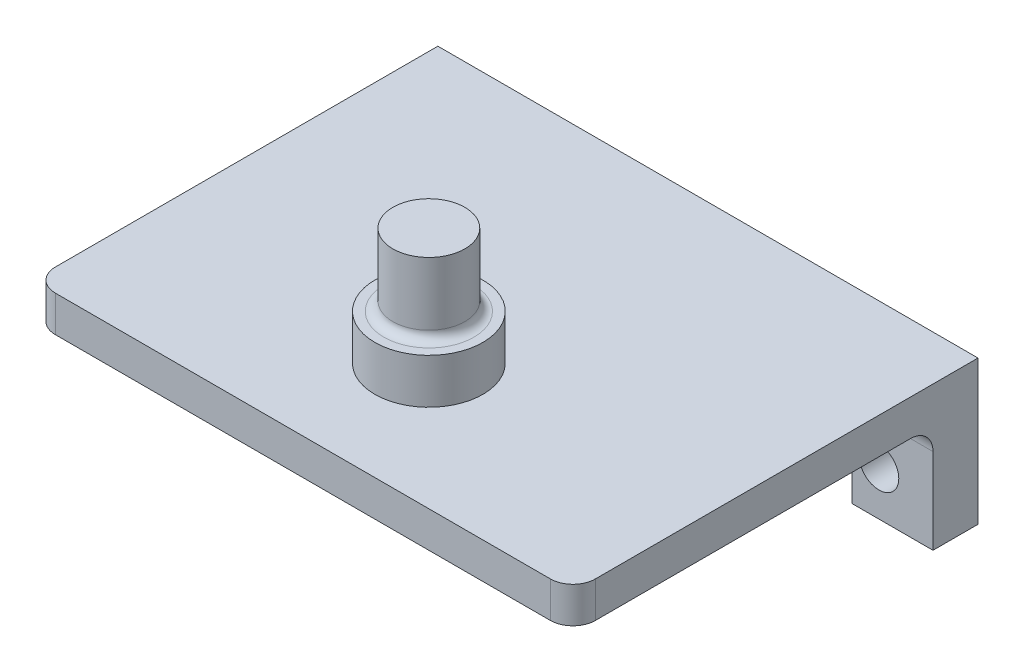
ISO-10303-21;
HEADER;
FILE_DESCRIPTION(('STEP AP214'),'2;1');
FILE_NAME('part.step','',(''),(''),'','','');
FILE_SCHEMA(('AUTOMOTIVE_DESIGN { 1 0 10303 214 1 1 1 1 }'));
ENDSEC;
DATA;
#1=APPLICATION_CONTEXT('core data for automotive mechanical design processes');
#2=APPLICATION_PROTOCOL_DEFINITION('international standard','automotive_design',2000,#1);
#3=PRODUCT_CONTEXT('',#1,'mechanical');
#4=PRODUCT('Part','Part','',(#3));
#5=PRODUCT_RELATED_PRODUCT_CATEGORY('part','',(#4));
#6=PRODUCT_DEFINITION_FORMATION('','',#4);
#7=PRODUCT_DEFINITION_CONTEXT('part definition',#1,'design');
#8=PRODUCT_DEFINITION('design','',#6,#7);
#9=PRODUCT_DEFINITION_SHAPE('','',#8);
#10=(LENGTH_UNIT() NAMED_UNIT(*) SI_UNIT(.MILLI.,.METRE.));
#11=(NAMED_UNIT(*) PLANE_ANGLE_UNIT() SI_UNIT($,.RADIAN.));
#12=(NAMED_UNIT(*) SI_UNIT($,.STERADIAN.) SOLID_ANGLE_UNIT());
#13=UNCERTAINTY_MEASURE_WITH_UNIT(LENGTH_MEASURE(1.E-05),#10,'distance_accuracy_value','');
#14=(GEOMETRIC_REPRESENTATION_CONTEXT(3) GLOBAL_UNCERTAINTY_ASSIGNED_CONTEXT((#13)) GLOBAL_UNIT_ASSIGNED_CONTEXT((#10,
#11,#12)) REPRESENTATION_CONTEXT('',''));
#15=CARTESIAN_POINT('',(0.,0.,0.));
#16=DIRECTION('',(0.,0.,1.));
#17=DIRECTION('',(1.,0.,0.));
#18=AXIS2_PLACEMENT_3D('',#15,#16,#17);
#19=CARTESIAN_POINT('',(-112.025641025641,3.8866701879706E-13,45.));
#20=DIRECTION('',(1.,0.,0.));
#21=DIRECTION('',(0.,1.,0.));
#22=AXIS2_PLACEMENT_3D('',#19,#20,#21);
#23=PLANE('',#22);
#24=DIRECTION('',(0.,-1.,0.));
#25=VECTOR('',#24,1.);
#26=CARTESIAN_POINT('',(-112.025641025641,3.8866701879706E-13,0.));
#27=LINE('',#26,#25);
#28=CARTESIAN_POINT('',(-112.025641025641,35.6851761951193,0.));
#29=VERTEX_POINT('',#28);
#30=CARTESIAN_POINT('',(-112.025641025641,19.6851761951191,0.));
#31=VERTEX_POINT('',#30);
#32=EDGE_CURVE('E166',#29,#31,#27,.T.);
#33=ORIENTED_EDGE('',*,*,#32,.T.);
#34=DIRECTION('',(0.,0.,1.));
#35=VECTOR('',#34,1.);
#36=CARTESIAN_POINT('',(-112.025641025641,19.6851761951191,0.));
#37=LINE('',#36,#35);
#38=CARTESIAN_POINT('',(-112.025641025641,19.6851761951191,5.));
#39=VERTEX_POINT('',#38);
#40=EDGE_CURVE('E148',#31,#39,#37,.T.);
#41=ORIENTED_EDGE('',*,*,#40,.T.);
#42=DIRECTION('',(0.,1.,0.));
#43=VECTOR('',#42,1.);
#44=CARTESIAN_POINT('',(-112.025641025641,0.,5.));
#45=LINE('',#44,#43);
#46=CARTESIAN_POINT('',(-112.025641025641,29.1851761951193,5.));
#47=VERTEX_POINT('',#46);
#48=EDGE_CURVE('E185',#39,#47,#45,.T.);
#49=ORIENTED_EDGE('',*,*,#48,.T.);
#50=CARTESIAN_POINT('',(-112.025641025641,29.1851761951193,7.5));
#51=DIRECTION('',(1.,0.,0.));
#52=DIRECTION('',(0.,1.,0.));
#53=AXIS2_PLACEMENT_3D('',#50,#51,#52);
#54=CIRCLE('',#53,2.5);
#55=CARTESIAN_POINT('',(-112.025641025641,31.6851761951193,7.50000000000001));
#56=VERTEX_POINT('',#55);
#57=EDGE_CURVE('E239',#47,#56,#54,.T.);
#58=ORIENTED_EDGE('',*,*,#57,.T.);
#59=DIRECTION('',(0.,0.,-1.));
#60=VECTOR('',#59,1.);
#61=CARTESIAN_POINT('',(-112.025641025641,31.6851761951193,45.));
#62=LINE('',#61,#60);
#63=CARTESIAN_POINT('',(-112.025641025641,31.6851761951193,42.5));
#64=VERTEX_POINT('',#63);
#65=EDGE_CURVE('E287',#64,#56,#62,.T.);
#66=ORIENTED_EDGE('',*,*,#65,.F.);
#67=DIRECTION('',(0.,1.,0.));
#68=VECTOR('',#67,1.);
#69=CARTESIAN_POINT('',(-112.025641025641,35.6851761951193,42.5));
#70=LINE('',#69,#68);
#71=CARTESIAN_POINT('',(-112.025641025641,35.6851761951193,42.5));
#72=VERTEX_POINT('',#71);
#73=EDGE_CURVE('E210',#64,#72,#70,.T.);
#74=ORIENTED_EDGE('',*,*,#73,.T.);
#75=DIRECTION('',(0.,0.,-1.));
#76=VECTOR('',#75,1.);
#77=CARTESIAN_POINT('',(-112.025641025641,35.6851761951193,45.));
#78=LINE('',#77,#76);
#79=EDGE_CURVE('E175',#72,#29,#78,.T.);
#80=ORIENTED_EDGE('',*,*,#79,.T.);
#81=EDGE_LOOP('',(#33,#41,#49,#58,#66,#74,#80));
#82=FACE_BOUND('',#81,.T.);
#83=ADVANCED_FACE('F49',(#82),#23,.F.);
#84=CARTESIAN_POINT('',(-52.0256410256409,-1.80500201679843E-13,45.));
#85=DIRECTION('',(1.,0.,0.));
#86=DIRECTION('',(0.,1.,0.));
#87=AXIS2_PLACEMENT_3D('',#84,#85,#86);
#88=PLANE('',#87);
#89=DIRECTION('',(0.,0.,1.));
#90=VECTOR('',#89,1.);
#91=CARTESIAN_POINT('',(-52.025641025641,19.6851761951193,0.));
#92=LINE('',#91,#90);
#93=CARTESIAN_POINT('',(-52.025641025641,19.6851761951193,0.));
#94=VERTEX_POINT('',#93);
#95=CARTESIAN_POINT('',(-52.0256410256409,19.6851761951193,5.));
#96=VERTEX_POINT('',#95);
#97=EDGE_CURVE('E72',#94,#96,#92,.T.);
#98=ORIENTED_EDGE('',*,*,#97,.F.);
#99=DIRECTION('',(0.,-1.,0.));
#100=VECTOR('',#99,1.);
#101=CARTESIAN_POINT('',(-52.0256410256409,-1.80500201679843E-13,0.));
#102=LINE('',#101,#100);
#103=CARTESIAN_POINT('',(-52.0256410256409,35.6851761951193,0.));
#104=VERTEX_POINT('',#103);
#105=EDGE_CURVE('E177',#104,#94,#102,.T.);
#106=ORIENTED_EDGE('',*,*,#105,.F.);
#107=DIRECTION('',(0.,0.,-1.));
#108=VECTOR('',#107,1.);
#109=CARTESIAN_POINT('',(-52.0256410256409,35.6851761951193,45.));
#110=LINE('',#109,#108);
#111=CARTESIAN_POINT('',(-52.0256410256409,35.6851761951193,42.5));
#112=VERTEX_POINT('',#111);
#113=EDGE_CURVE('E296',#112,#104,#110,.T.);
#114=ORIENTED_EDGE('',*,*,#113,.F.);
#115=DIRECTION('',(0.,1.,0.));
#116=VECTOR('',#115,1.);
#117=CARTESIAN_POINT('',(-52.0256410256409,-1.80500201679843E-13,42.5));
#118=LINE('',#117,#116);
#119=CARTESIAN_POINT('',(-52.0256410256409,31.6851761951193,42.5));
#120=VERTEX_POINT('',#119);
#121=EDGE_CURVE('E201',#112,#120,#118,.F.);
#122=ORIENTED_EDGE('',*,*,#121,.T.);
#123=DIRECTION('',(0.,0.,-1.));
#124=VECTOR('',#123,1.);
#125=CARTESIAN_POINT('',(-52.0256410256409,31.6851761951193,45.));
#126=LINE('',#125,#124);
#127=CARTESIAN_POINT('',(-52.0256410256409,31.6851761951193,7.50000000000001));
#128=VERTEX_POINT('',#127);
#129=EDGE_CURVE('E299',#120,#128,#126,.T.);
#130=ORIENTED_EDGE('',*,*,#129,.T.);
#131=CARTESIAN_POINT('',(-52.025641025641,29.1851761951193,7.5));
#132=DIRECTION('',(1.,0.,0.));
#133=DIRECTION('',(0.,1.,0.));
#134=AXIS2_PLACEMENT_3D('',#131,#132,#133);
#135=CIRCLE('',#134,2.5);
#136=CARTESIAN_POINT('',(-52.0256410256409,29.1851761951193,5.));
#137=VERTEX_POINT('',#136);
#138=EDGE_CURVE('E228',#128,#137,#135,.F.);
#139=ORIENTED_EDGE('',*,*,#138,.T.);
#140=DIRECTION('',(0.,1.,0.));
#141=VECTOR('',#140,1.);
#142=CARTESIAN_POINT('',(-52.025641025641,0.,5.));
#143=LINE('',#142,#141);
#144=EDGE_CURVE('E304',#96,#137,#143,.T.);
#145=ORIENTED_EDGE('',*,*,#144,.F.);
#146=EDGE_LOOP('',(#98,#106,#114,#122,#130,#139,#145));
#147=FACE_BOUND('',#146,.T.);
#148=ADVANCED_FACE('F360',(#147),#88,.T.);
#149=CARTESIAN_POINT('',(0.,0.,0.));
#150=DIRECTION('',(0.,0.,1.));
#151=DIRECTION('',(1.,0.,0.));
#152=AXIS2_PLACEMENT_3D('',#149,#150,#151);
#153=PLANE('',#152);
#154=ORIENTED_EDGE('',*,*,#105,.T.);
#155=DIRECTION('',(1.,0.,0.));
#156=VECTOR('',#155,1.);
#157=CARTESIAN_POINT('',(-112.025641025641,19.6851761951191,0.));
#158=LINE('',#157,#156);
#159=CARTESIAN_POINT('',(-61.025641025641,19.6851761951193,0.));
#160=VERTEX_POINT('',#159);
#161=EDGE_CURVE('E157',#160,#94,#158,.T.);
#162=ORIENTED_EDGE('',*,*,#161,.F.);
#163=DIRECTION('',(0.,-1.,0.));
#164=VECTOR('',#163,1.);
#165=CARTESIAN_POINT('',(-61.0256410256409,0.,0.));
#166=LINE('',#165,#164);
#167=CARTESIAN_POINT('',(-61.0256410256409,31.6851761951193,0.));
#168=VERTEX_POINT('',#167);
#169=EDGE_CURVE('E303',#168,#160,#166,.T.);
#170=ORIENTED_EDGE('',*,*,#169,.F.);
#171=DIRECTION('',(1.,0.,0.));
#172=VECTOR('',#171,1.);
#173=CARTESIAN_POINT('',(0.,31.6851761951193,0.));
#174=LINE('',#173,#172);
#175=CARTESIAN_POINT('',(-103.025641025641,31.6851761951193,0.));
#176=VERTEX_POINT('',#175);
#177=EDGE_CURVE('E267',#176,#168,#174,.T.);
#178=ORIENTED_EDGE('',*,*,#177,.F.);
#179=DIRECTION('',(0.,-1.,0.));
#180=VECTOR('',#179,1.);
#181=CARTESIAN_POINT('',(-103.025641025641,-9.53178656611939E-13,0.));
#182=LINE('',#181,#180);
#183=CARTESIAN_POINT('',(-103.025641025641,19.6851761951191,0.));
#184=VERTEX_POINT('',#183);
#185=EDGE_CURVE('E169',#176,#184,#182,.T.);
#186=ORIENTED_EDGE('',*,*,#185,.T.);
#187=EDGE_CURVE('E151',#31,#184,#158,.T.);
#188=ORIENTED_EDGE('',*,*,#187,.F.);
#189=ORIENTED_EDGE('',*,*,#32,.F.);
#190=DIRECTION('',(1.,0.,0.));
#191=VECTOR('',#190,1.);
#192=CARTESIAN_POINT('',(0.,35.6851761951193,0.));
#193=LINE('',#192,#191);
#194=EDGE_CURVE('E273',#29,#104,#193,.T.);
#195=ORIENTED_EDGE('',*,*,#194,.T.);
#196=EDGE_LOOP('',(#154,#162,#170,#178,#186,#188,#189,#195));
#197=FACE_BOUND('',#196,.T.);
#198=CARTESIAN_POINT('',(-106.025641025641,24.6851761951193,0.));
#199=DIRECTION('',(0.,0.,1.));
#200=DIRECTION('',(1.,0.,0.));
#201=AXIS2_PLACEMENT_3D('',#198,#199,#200);
#202=CIRCLE('',#201,2.2);
#203=CARTESIAN_POINT('',(-103.825641025641,24.6851761951193,0.));
#204=VERTEX_POINT('',#203);
#205=EDGE_CURVE('E325',#204,#204,#202,.T.);
#206=ORIENTED_EDGE('',*,*,#205,.T.);
#207=EDGE_LOOP('',(#206));
#208=FACE_BOUND('',#207,.T.);
#209=CARTESIAN_POINT('',(-58.025641025641,24.6851761951193,0.));
#210=DIRECTION('',(0.,0.,1.));
#211=DIRECTION('',(1.,0.,0.));
#212=AXIS2_PLACEMENT_3D('',#209,#210,#211);
#213=CIRCLE('',#212,2.2);
#214=CARTESIAN_POINT('',(-55.825641025641,24.6851761951193,0.));
#215=VERTEX_POINT('',#214);
#216=EDGE_CURVE('E308',#215,#215,#213,.F.);
#217=ORIENTED_EDGE('',*,*,#216,.F.);
#218=EDGE_LOOP('',(#217));
#219=FACE_BOUND('',#218,.T.);
#220=ADVANCED_FACE('F163',(#197,#208,#219),#153,.F.);
#221=CARTESIAN_POINT('',(-103.025641025641,-9.53178656611939E-13,5.));
#222=DIRECTION('',(1.,0.,0.));
#223=DIRECTION('',(0.,1.,0.));
#224=AXIS2_PLACEMENT_3D('',#221,#222,#223);
#225=PLANE('',#224);
#226=DIRECTION('',(0.,0.,1.));
#227=VECTOR('',#226,1.);
#228=CARTESIAN_POINT('',(-103.025641025641,19.6851761951191,5.));
#229=LINE('',#228,#227);
#230=CARTESIAN_POINT('',(-103.025641025641,19.6851761951191,5.));
#231=VERTEX_POINT('',#230);
#232=EDGE_CURVE('E65',#184,#231,#229,.T.);
#233=ORIENTED_EDGE('',*,*,#232,.F.);
#234=ORIENTED_EDGE('',*,*,#185,.F.);
#235=DIRECTION('',(0.,0.,-1.));
#236=VECTOR('',#235,1.);
#237=CARTESIAN_POINT('',(-103.025641025641,31.6851761951193,5.));
#238=LINE('',#237,#236);
#239=CARTESIAN_POINT('',(-103.025641025641,31.6851761951193,7.5));
#240=VERTEX_POINT('',#239);
#241=EDGE_CURVE('E178',#240,#176,#238,.T.);
#242=ORIENTED_EDGE('',*,*,#241,.F.);
#243=CARTESIAN_POINT('',(-103.025641025641,29.1851761951193,7.5));
#244=DIRECTION('',(1.,0.,0.));
#245=DIRECTION('',(0.,1.,0.));
#246=AXIS2_PLACEMENT_3D('',#243,#244,#245);
#247=CIRCLE('',#246,2.5);
#248=CARTESIAN_POINT('',(-103.025641025641,29.1851761951193,5.));
#249=VERTEX_POINT('',#248);
#250=EDGE_CURVE('E236',#240,#249,#247,.F.);
#251=ORIENTED_EDGE('',*,*,#250,.T.);
#252=DIRECTION('',(0.,-1.,0.));
#253=VECTOR('',#252,1.);
#254=CARTESIAN_POINT('',(-103.025641025641,-9.53178656611939E-13,5.));
#255=LINE('',#254,#253);
#256=EDGE_CURVE('E330',#249,#231,#255,.T.);
#257=ORIENTED_EDGE('',*,*,#256,.T.);
#258=EDGE_LOOP('',(#233,#234,#242,#251,#257));
#259=FACE_BOUND('',#258,.T.);
#260=ADVANCED_FACE('F345',(#259),#225,.T.);
#261=CARTESIAN_POINT('',(-106.025641025641,24.6851761951193,5.));
#262=DIRECTION('',(0.,0.,-1.));
#263=DIRECTION('',(-1.,0.,0.));
#264=AXIS2_PLACEMENT_3D('',#261,#262,#263);
#265=CYLINDRICAL_SURFACE('',#264,2.2);
#266=CARTESIAN_POINT('',(-106.025641025641,24.6851761951193,5.));
#267=DIRECTION('',(0.,0.,1.));
#268=DIRECTION('',(1.,0.,0.));
#269=AXIS2_PLACEMENT_3D('',#266,#267,#268);
#270=CIRCLE('',#269,2.2);
#271=CARTESIAN_POINT('',(-103.825641025641,24.6851761951193,5.));
#272=VERTEX_POINT('',#271);
#273=EDGE_CURVE('E326',#272,#272,#270,.T.);
#274=ORIENTED_EDGE('',*,*,#273,.T.);
#275=EDGE_LOOP('',(#274));
#276=FACE_BOUND('',#275,.T.);
#277=ORIENTED_EDGE('',*,*,#205,.F.);
#278=EDGE_LOOP('',(#277));
#279=FACE_BOUND('',#278,.T.);
#280=ADVANCED_FACE('F342',(#276,#279),#265,.F.);
#281=CARTESIAN_POINT('',(0.,0.,5.));
#282=DIRECTION('',(0.,0.,1.));
#283=DIRECTION('',(1.,0.,0.));
#284=AXIS2_PLACEMENT_3D('',#281,#282,#283);
#285=PLANE('',#284);
#286=DIRECTION('',(-1.,0.,0.));
#287=VECTOR('',#286,1.);
#288=CARTESIAN_POINT('',(0.,19.6851761951195,5.));
#289=LINE('',#288,#287);
#290=EDGE_CURVE('E152',#231,#39,#289,.T.);
#291=ORIENTED_EDGE('',*,*,#290,.F.);
#292=ORIENTED_EDGE('',*,*,#256,.F.);
#293=DIRECTION('',(1.,0.,0.));
#294=VECTOR('',#293,1.);
#295=CARTESIAN_POINT('',(0.,29.1851761951193,5.));
#296=LINE('',#295,#294);
#297=EDGE_CURVE('E213',#249,#47,#296,.F.);
#298=ORIENTED_EDGE('',*,*,#297,.T.);
#299=ORIENTED_EDGE('',*,*,#48,.F.);
#300=EDGE_LOOP('',(#291,#292,#298,#299));
#301=FACE_BOUND('',#300,.T.);
#302=ORIENTED_EDGE('',*,*,#273,.F.);
#303=EDGE_LOOP('',(#302));
#304=FACE_BOUND('',#303,.T.);
#305=ADVANCED_FACE('F344',(#301,#304),#285,.T.);
#306=CARTESIAN_POINT('',(-61.0256410256409,0.,5.));
#307=DIRECTION('',(1.,0.,0.));
#308=DIRECTION('',(0.,0.,-1.));
#309=AXIS2_PLACEMENT_3D('',#306,#307,#308);
#310=PLANE('',#309);
#311=ORIENTED_EDGE('',*,*,#169,.T.);
#312=DIRECTION('',(0.,0.,1.));
#313=VECTOR('',#312,1.);
#314=CARTESIAN_POINT('',(-61.0256410256409,19.6851761951193,5.));
#315=LINE('',#314,#313);
#316=CARTESIAN_POINT('',(-61.0256410256409,19.6851761951193,5.));
#317=VERTEX_POINT('',#316);
#318=EDGE_CURVE('E171',#160,#317,#315,.T.);
#319=ORIENTED_EDGE('',*,*,#318,.T.);
#320=DIRECTION('',(0.,-1.,0.));
#321=VECTOR('',#320,1.);
#322=CARTESIAN_POINT('',(-61.0256410256409,0.,5.));
#323=LINE('',#322,#321);
#324=CARTESIAN_POINT('',(-61.0256410256409,29.1851761951193,5.));
#325=VERTEX_POINT('',#324);
#326=EDGE_CURVE('E307',#325,#317,#323,.T.);
#327=ORIENTED_EDGE('',*,*,#326,.F.);
#328=CARTESIAN_POINT('',(-61.0256410256409,29.1851761951193,7.5));
#329=DIRECTION('',(1.,0.,0.));
#330=DIRECTION('',(0.,0.,-1.));
#331=AXIS2_PLACEMENT_3D('',#328,#329,#330);
#332=CIRCLE('',#331,2.5);
#333=CARTESIAN_POINT('',(-61.0256410256409,31.6851761951193,7.5));
#334=VERTEX_POINT('',#333);
#335=EDGE_CURVE('E232',#325,#334,#332,.T.);
#336=ORIENTED_EDGE('',*,*,#335,.T.);
#337=DIRECTION('',(0.,0.,-1.));
#338=VECTOR('',#337,1.);
#339=CARTESIAN_POINT('',(-61.0256410256409,31.6851761951193,5.));
#340=LINE('',#339,#338);
#341=EDGE_CURVE('E316',#334,#168,#340,.T.);
#342=ORIENTED_EDGE('',*,*,#341,.T.);
#343=EDGE_LOOP('',(#311,#319,#327,#336,#342));
#344=FACE_BOUND('',#343,.T.);
#345=ADVANCED_FACE('F352',(#344),#310,.F.);
#346=CARTESIAN_POINT('',(-58.025641025641,24.6851761951193,5.));
#347=DIRECTION('',(0.,0.,-1.));
#348=DIRECTION('',(-1.,0.,0.));
#349=AXIS2_PLACEMENT_3D('',#346,#347,#348);
#350=CYLINDRICAL_SURFACE('',#349,2.2);
#351=CARTESIAN_POINT('',(-58.025641025641,24.6851761951193,5.));
#352=DIRECTION('',(0.,0.,1.));
#353=DIRECTION('',(1.,0.,0.));
#354=AXIS2_PLACEMENT_3D('',#351,#352,#353);
#355=CIRCLE('',#354,2.2);
#356=CARTESIAN_POINT('',(-55.825641025641,24.6851761951193,5.));
#357=VERTEX_POINT('',#356);
#358=EDGE_CURVE('E312',#357,#357,#355,.F.);
#359=ORIENTED_EDGE('',*,*,#358,.F.);
#360=EDGE_LOOP('',(#359));
#361=FACE_BOUND('',#360,.T.);
#362=ORIENTED_EDGE('',*,*,#216,.T.);
#363=EDGE_LOOP('',(#362));
#364=FACE_BOUND('',#363,.T.);
#365=ADVANCED_FACE('F437',(#361,#364),#350,.F.);
#366=CARTESIAN_POINT('',(0.,0.,5.));
#367=DIRECTION('',(0.,0.,1.));
#368=DIRECTION('',(1.,0.,0.));
#369=AXIS2_PLACEMENT_3D('',#366,#367,#368);
#370=PLANE('',#369);
#371=DIRECTION('',(-1.,0.,0.));
#372=VECTOR('',#371,1.);
#373=CARTESIAN_POINT('',(0.,19.6851761951195,5.));
#374=LINE('',#373,#372);
#375=EDGE_CURVE('E11',#96,#317,#374,.T.);
#376=ORIENTED_EDGE('',*,*,#375,.F.);
#377=ORIENTED_EDGE('',*,*,#144,.T.);
#378=DIRECTION('',(1.,0.,0.));
#379=VECTOR('',#378,1.);
#380=CARTESIAN_POINT('',(0.,29.1851761951193,5.));
#381=LINE('',#380,#379);
#382=EDGE_CURVE('E217',#137,#325,#381,.F.);
#383=ORIENTED_EDGE('',*,*,#382,.T.);
#384=ORIENTED_EDGE('',*,*,#326,.T.);
#385=EDGE_LOOP('',(#376,#377,#383,#384));
#386=FACE_BOUND('',#385,.T.);
#387=ORIENTED_EDGE('',*,*,#358,.T.);
#388=EDGE_LOOP('',(#387));
#389=FACE_BOUND('',#388,.T.);
#390=ADVANCED_FACE('F432',(#386,#389),#370,.T.);
#391=CARTESIAN_POINT('',(0.,31.6851761951193,45.));
#392=DIRECTION('',(0.,1.,0.));
#393=DIRECTION('',(-1.,0.,0.));
#394=AXIS2_PLACEMENT_3D('',#391,#392,#393);
#395=PLANE('',#394);
#396=ORIENTED_EDGE('',*,*,#341,.F.);
#397=DIRECTION('',(1.,0.,0.));
#398=VECTOR('',#397,1.);
#399=CARTESIAN_POINT('',(0.,31.6851761951193,7.5));
#400=LINE('',#399,#398);
#401=EDGE_CURVE('E224',#334,#128,#400,.T.);
#402=ORIENTED_EDGE('',*,*,#401,.T.);
#403=ORIENTED_EDGE('',*,*,#129,.F.);
#404=CARTESIAN_POINT('',(-54.525641025641,31.6851761951193,42.5));
#405=DIRECTION('',(0.,1.,0.));
#406=DIRECTION('',(-1.,0.,0.));
#407=AXIS2_PLACEMENT_3D('',#404,#405,#406);
#408=CIRCLE('',#407,2.5);
#409=CARTESIAN_POINT('',(-54.525641025641,31.6851761951193,45.));
#410=VERTEX_POINT('',#409);
#411=EDGE_CURVE('E207',#120,#410,#408,.F.);
#412=ORIENTED_EDGE('',*,*,#411,.T.);
#413=DIRECTION('',(1.,0.,0.));
#414=VECTOR('',#413,1.);
#415=CARTESIAN_POINT('',(0.,31.6851761951193,45.));
#416=LINE('',#415,#414);
#417=CARTESIAN_POINT('',(-109.525641025641,31.6851761951193,45.));
#418=VERTEX_POINT('',#417);
#419=EDGE_CURVE('E280',#418,#410,#416,.T.);
#420=ORIENTED_EDGE('',*,*,#419,.F.);
#421=CARTESIAN_POINT('',(-109.525641025641,31.6851761951193,42.5));
#422=DIRECTION('',(0.,1.,0.));
#423=DIRECTION('',(-1.,0.,0.));
#424=AXIS2_PLACEMENT_3D('',#421,#422,#423);
#425=CIRCLE('',#424,2.5);
#426=EDGE_CURVE('E204',#418,#64,#425,.F.);
#427=ORIENTED_EDGE('',*,*,#426,.T.);
#428=ORIENTED_EDGE('',*,*,#65,.T.);
#429=DIRECTION('',(1.,0.,0.));
#430=VECTOR('',#429,1.);
#431=CARTESIAN_POINT('',(0.,31.6851761951193,7.5));
#432=LINE('',#431,#430);
#433=EDGE_CURVE('E220',#56,#240,#432,.T.);
#434=ORIENTED_EDGE('',*,*,#433,.T.);
#435=ORIENTED_EDGE('',*,*,#241,.T.);
#436=ORIENTED_EDGE('',*,*,#177,.T.);
#437=EDGE_LOOP('',(#396,#402,#403,#412,#420,#427,#428,#434,#435,#436));
#438=FACE_BOUND('',#437,.T.);
#439=ADVANCED_FACE('F397',(#438),#395,.F.);
#440=CARTESIAN_POINT('',(0.,35.6851761951193,45.));
#441=DIRECTION('',(0.,1.,0.));
#442=DIRECTION('',(-1.,0.,0.));
#443=AXIS2_PLACEMENT_3D('',#440,#441,#442);
#444=PLANE('',#443);
#445=CARTESIAN_POINT('',(-82.0256410256409,35.6851761951193,31.));
#446=DIRECTION('',(0.,1.,0.));
#447=DIRECTION('',(0.,0.,1.));
#448=AXIS2_PLACEMENT_3D('',#445,#446,#447);
#449=CIRCLE('',#448,6.);
#450=CARTESIAN_POINT('',(-82.0256410256409,35.6851761951193,37.));
#451=VERTEX_POINT('',#450);
#452=EDGE_CURVE('E276',#451,#451,#449,.T.);
#453=ORIENTED_EDGE('',*,*,#452,.F.);
#454=EDGE_LOOP('',(#453));
#455=FACE_BOUND('',#454,.T.);
#456=DIRECTION('',(1.,0.,0.));
#457=VECTOR('',#456,1.);
#458=CARTESIAN_POINT('',(0.,35.6851761951193,45.));
#459=LINE('',#458,#457);
#460=CARTESIAN_POINT('',(-109.525641025641,35.6851761951193,45.));
#461=VERTEX_POINT('',#460);
#462=CARTESIAN_POINT('',(-54.5256410256411,35.6851761951193,45.));
#463=VERTEX_POINT('',#462);
#464=EDGE_CURVE('E284',#461,#463,#459,.T.);
#465=ORIENTED_EDGE('',*,*,#464,.T.);
#466=CARTESIAN_POINT('',(-54.5256410256411,35.6851761951193,42.5));
#467=DIRECTION('',(0.,1.,0.));
#468=DIRECTION('',(-1.,0.,0.));
#469=AXIS2_PLACEMENT_3D('',#466,#467,#468);
#470=CIRCLE('',#469,2.5);
#471=EDGE_CURVE('E198',#463,#112,#470,.T.);
#472=ORIENTED_EDGE('',*,*,#471,.T.);
#473=ORIENTED_EDGE('',*,*,#113,.T.);
#474=ORIENTED_EDGE('',*,*,#194,.F.);
#475=ORIENTED_EDGE('',*,*,#79,.F.);
#476=CARTESIAN_POINT('',(-109.525641025641,35.6851761951193,42.5));
#477=DIRECTION('',(0.,1.,0.));
#478=DIRECTION('',(-1.,0.,0.));
#479=AXIS2_PLACEMENT_3D('',#476,#477,#478);
#480=CIRCLE('',#479,2.5);
#481=EDGE_CURVE('E195',#72,#461,#480,.T.);
#482=ORIENTED_EDGE('',*,*,#481,.T.);
#483=EDGE_LOOP('',(#465,#472,#473,#474,#475,#482));
#484=FACE_BOUND('',#483,.T.);
#485=ADVANCED_FACE('F402',(#455,#484),#444,.T.);
#486=CARTESIAN_POINT('',(0.,0.,45.));
#487=DIRECTION('',(0.,0.,1.));
#488=DIRECTION('',(1.,0.,0.));
#489=AXIS2_PLACEMENT_3D('',#486,#487,#488);
#490=PLANE('',#489);
#491=ORIENTED_EDGE('',*,*,#419,.T.);
#492=DIRECTION('',(0.,1.,0.));
#493=VECTOR('',#492,1.);
#494=CARTESIAN_POINT('',(-54.5256410256409,-1.89173819059727E-13,45.));
#495=LINE('',#494,#493);
#496=EDGE_CURVE('E191',#410,#463,#495,.T.);
#497=ORIENTED_EDGE('',*,*,#496,.T.);
#498=ORIENTED_EDGE('',*,*,#464,.F.);
#499=DIRECTION('',(0.,1.,0.));
#500=VECTOR('',#499,1.);
#501=CARTESIAN_POINT('',(-109.525641025641,31.6851761951193,45.));
#502=LINE('',#501,#500);
#503=EDGE_CURVE('E182',#461,#418,#502,.F.);
#504=ORIENTED_EDGE('',*,*,#503,.T.);
#505=EDGE_LOOP('',(#491,#497,#498,#504));
#506=FACE_BOUND('',#505,.T.);
#507=ADVANCED_FACE('F372',(#506),#490,.T.);
#508=CARTESIAN_POINT('',(-54.5256410256409,-1.89173819059727E-13,42.5));
#509=DIRECTION('',(0.,1.,0.));
#510=DIRECTION('',(-1.,0.,0.));
#511=AXIS2_PLACEMENT_3D('',#508,#509,#510);
#512=CYLINDRICAL_SURFACE('',#511,2.5);
#513=ORIENTED_EDGE('',*,*,#411,.F.);
#514=ORIENTED_EDGE('',*,*,#121,.F.);
#515=ORIENTED_EDGE('',*,*,#471,.F.);
#516=ORIENTED_EDGE('',*,*,#496,.F.);
#517=EDGE_LOOP('',(#513,#514,#515,#516));
#518=FACE_BOUND('',#517,.T.);
#519=ADVANCED_FACE('F368',(#518),#512,.T.);
#520=CARTESIAN_POINT('',(-109.525641025641,3.79993401417176E-13,42.5));
#521=DIRECTION('',(0.,-1.,0.));
#522=DIRECTION('',(1.,0.,0.));
#523=AXIS2_PLACEMENT_3D('',#520,#521,#522);
#524=CYLINDRICAL_SURFACE('',#523,2.5);
#525=ORIENTED_EDGE('',*,*,#426,.F.);
#526=ORIENTED_EDGE('',*,*,#503,.F.);
#527=ORIENTED_EDGE('',*,*,#481,.F.);
#528=ORIENTED_EDGE('',*,*,#73,.F.);
#529=EDGE_LOOP('',(#525,#526,#527,#528));
#530=FACE_BOUND('',#529,.T.);
#531=ADVANCED_FACE('F371',(#530),#524,.T.);
#532=CARTESIAN_POINT('',(0.,29.1851761951193,7.5));
#533=DIRECTION('',(1.,0.,0.));
#534=DIRECTION('',(0.,1.,0.));
#535=AXIS2_PLACEMENT_3D('',#532,#533,#534);
#536=CYLINDRICAL_SURFACE('',#535,2.5);
#537=ORIENTED_EDGE('',*,*,#335,.F.);
#538=ORIENTED_EDGE('',*,*,#382,.F.);
#539=ORIENTED_EDGE('',*,*,#138,.F.);
#540=ORIENTED_EDGE('',*,*,#401,.F.);
#541=EDGE_LOOP('',(#537,#538,#539,#540));
#542=FACE_BOUND('',#541,.T.);
#543=ADVANCED_FACE('F376',(#542),#536,.F.);
#544=CARTESIAN_POINT('',(0.,29.1851761951193,7.5));
#545=DIRECTION('',(1.,0.,0.));
#546=DIRECTION('',(0.,1.,0.));
#547=AXIS2_PLACEMENT_3D('',#544,#545,#546);
#548=CYLINDRICAL_SURFACE('',#547,2.5);
#549=ORIENTED_EDGE('',*,*,#57,.F.);
#550=ORIENTED_EDGE('',*,*,#297,.F.);
#551=ORIENTED_EDGE('',*,*,#250,.F.);
#552=ORIENTED_EDGE('',*,*,#433,.F.);
#553=EDGE_LOOP('',(#549,#550,#551,#552));
#554=FACE_BOUND('',#553,.T.);
#555=ADVANCED_FACE('F379',(#554),#548,.F.);
#556=CARTESIAN_POINT('',(-82.0256410256409,40.6851761951193,31.));
#557=DIRECTION('',(0.,-1.,0.));
#558=DIRECTION('',(0.,0.,-1.));
#559=AXIS2_PLACEMENT_3D('',#556,#557,#558);
#560=CYLINDRICAL_SURFACE('',#559,6.);
#561=CARTESIAN_POINT('',(-82.0256410256409,40.6851761951193,31.));
#562=DIRECTION('',(0.,1.,0.));
#563=DIRECTION('',(0.,0.,1.));
#564=AXIS2_PLACEMENT_3D('',#561,#562,#563);
#565=CIRCLE('',#564,6.);
#566=CARTESIAN_POINT('',(-82.0256410256409,40.6851761951193,37.));
#567=VERTEX_POINT('',#566);
#568=EDGE_CURVE('E268',#567,#567,#565,.T.);
#569=ORIENTED_EDGE('',*,*,#568,.F.);
#570=EDGE_LOOP('',(#569));
#571=FACE_BOUND('',#570,.T.);
#572=ORIENTED_EDGE('',*,*,#452,.T.);
#573=EDGE_LOOP('',(#572));
#574=FACE_BOUND('',#573,.T.);
#575=ADVANCED_FACE('F382',(#571,#574),#560,.T.);
#576=CARTESIAN_POINT('',(-82.0256410256409,40.6851761951193,31.));
#577=DIRECTION('',(0.,1.,0.));
#578=DIRECTION('',(0.,0.,1.));
#579=AXIS2_PLACEMENT_3D('',#576,#577,#578);
#580=PLANE('',#579);
#581=CARTESIAN_POINT('',(-82.0256410256409,40.6851761951193,31.));
#582=DIRECTION('',(0.,1.,0.));
#583=DIRECTION('',(0.,0.,1.));
#584=AXIS2_PLACEMENT_3D('',#581,#582,#583);
#585=CIRCLE('',#584,5.00000000000001);
#586=CARTESIAN_POINT('',(-82.0256410256409,40.6851761951193,36.));
#587=VERTEX_POINT('',#586);
#588=EDGE_CURVE('E58',#587,#587,#585,.F.);
#589=ORIENTED_EDGE('',*,*,#588,.T.);
#590=EDGE_LOOP('',(#589));
#591=FACE_BOUND('',#590,.T.);
#592=ORIENTED_EDGE('',*,*,#568,.T.);
#593=EDGE_LOOP('',(#592));
#594=FACE_BOUND('',#593,.T.);
#595=ADVANCED_FACE('F249',(#591,#594),#580,.T.);
#596=CARTESIAN_POINT('',(-82.0256410256409,48.6851761951193,31.));
#597=DIRECTION('',(0.,1.,0.));
#598=DIRECTION('',(0.,0.,1.));
#599=AXIS2_PLACEMENT_3D('',#596,#597,#598);
#600=PLANE('',#599);
#601=CARTESIAN_POINT('',(-82.0256410256409,48.6851761951193,31.));
#602=DIRECTION('',(0.,1.,0.));
#603=DIRECTION('',(0.,0.,1.));
#604=AXIS2_PLACEMENT_3D('',#601,#602,#603);
#605=CIRCLE('',#604,4.00000000000001);
#606=CARTESIAN_POINT('',(-82.0256410256409,48.6851761951193,35.));
#607=VERTEX_POINT('',#606);
#608=EDGE_CURVE('E264',#607,#607,#605,.T.);
#609=ORIENTED_EDGE('',*,*,#608,.T.);
#610=EDGE_LOOP('',(#609));
#611=FACE_BOUND('',#610,.T.);
#612=ADVANCED_FACE('F260',(#611),#600,.T.);
#613=CARTESIAN_POINT('',(-82.0256410256409,48.6851761951193,31.));
#614=DIRECTION('',(0.,-1.,0.));
#615=DIRECTION('',(0.,0.,-1.));
#616=AXIS2_PLACEMENT_3D('',#613,#614,#615);
#617=CYLINDRICAL_SURFACE('',#616,4.00000000000001);
#618=CARTESIAN_POINT('',(-82.0256410256409,41.6851761951193,31.));
#619=DIRECTION('',(0.,1.,0.));
#620=DIRECTION('',(0.,0.,1.));
#621=AXIS2_PLACEMENT_3D('',#618,#619,#620);
#622=CIRCLE('',#621,4.00000000000001);
#623=CARTESIAN_POINT('',(-82.0256410256409,41.6851761951193,35.));
#624=VERTEX_POINT('',#623);
#625=EDGE_CURVE('E242',#624,#624,#622,.T.);
#626=ORIENTED_EDGE('',*,*,#625,.T.);
#627=EDGE_LOOP('',(#626));
#628=FACE_BOUND('',#627,.T.);
#629=ORIENTED_EDGE('',*,*,#608,.F.);
#630=EDGE_LOOP('',(#629));
#631=FACE_BOUND('',#630,.T.);
#632=ADVANCED_FACE('F255',(#628,#631),#617,.T.);
#633=CARTESIAN_POINT('',(-82.0256410256409,41.6851761951193,31.));
#634=DIRECTION('',(0.,1.,0.));
#635=DIRECTION('',(0.,0.,1.));
#636=AXIS2_PLACEMENT_3D('',#633,#634,#635);
#637=TOROIDAL_SURFACE('',#636,5.00000000000001,1.);
#638=ORIENTED_EDGE('',*,*,#588,.F.);
#639=EDGE_LOOP('',(#638));
#640=FACE_BOUND('',#639,.T.);
#641=ORIENTED_EDGE('',*,*,#625,.F.);
#642=EDGE_LOOP('',(#641));
#643=FACE_BOUND('',#642,.T.);
#644=ADVANCED_FACE('F51',(#640,#643),#637,.F.);
#645=CARTESIAN_POINT('',(-112.025641025641,19.6851761951191,0.));
#646=DIRECTION('',(0.,1.,0.));
#647=DIRECTION('',(-1.,0.,0.));
#648=AXIS2_PLACEMENT_3D('',#645,#646,#647);
#649=PLANE('',#648);
#650=ORIENTED_EDGE('',*,*,#161,.T.);
#651=ORIENTED_EDGE('',*,*,#97,.T.);
#652=ORIENTED_EDGE('',*,*,#375,.T.);
#653=ORIENTED_EDGE('',*,*,#318,.F.);
#654=EDGE_LOOP('',(#650,#651,#652,#653));
#655=FACE_BOUND('',#654,.T.);
#656=ADVANCED_FACE('F254',(#655),#649,.F.);
#657=ORIENTED_EDGE('',*,*,#232,.T.);
#658=ORIENTED_EDGE('',*,*,#290,.T.);
#659=ORIENTED_EDGE('',*,*,#40,.F.);
#660=ORIENTED_EDGE('',*,*,#187,.T.);
#661=EDGE_LOOP('',(#657,#658,#659,#660));
#662=FACE_BOUND('',#661,.T.);
#663=ADVANCED_FACE('F150',(#662),#649,.F.);
#664=CLOSED_SHELL('',(#83,#148,#220,#260,#280,#305,#345,#365,#390,#439,#485,#507,#519,#531,#543,
#555,#575,#595,#612,#632,#644,#656,#663));
#665=MANIFOLD_SOLID_BREP('B2',#664);
#666=ADVANCED_BREP_SHAPE_REPRESENTATION('',(#18,#665),#14);
#667=SHAPE_DEFINITION_REPRESENTATION(#9,#666);
ENDSEC;
END-ISO-10303-21;
